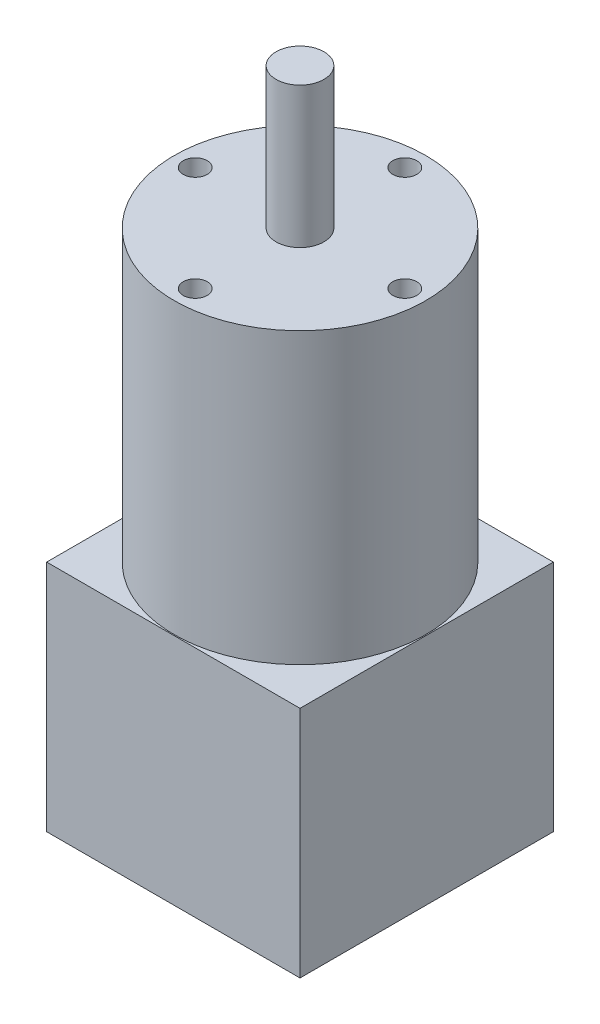
ISO-10303-21;
HEADER;
FILE_DESCRIPTION(('STEP AP214'),'2;1');
FILE_NAME('part.step','',(''),(''),'','','');
FILE_SCHEMA(('AUTOMOTIVE_DESIGN { 1 0 10303 214 1 1 1 1 }'));
ENDSEC;
DATA;
#1=APPLICATION_CONTEXT('core data for automotive mechanical design processes');
#2=APPLICATION_PROTOCOL_DEFINITION('international standard','automotive_design',2000,#1);
#3=PRODUCT_CONTEXT('',#1,'mechanical');
#4=PRODUCT('Part','Part','',(#3));
#5=PRODUCT_RELATED_PRODUCT_CATEGORY('part','',(#4));
#6=PRODUCT_DEFINITION_FORMATION('','',#4);
#7=PRODUCT_DEFINITION_CONTEXT('part definition',#1,'design');
#8=PRODUCT_DEFINITION('design','',#6,#7);
#9=PRODUCT_DEFINITION_SHAPE('','',#8);
#10=(LENGTH_UNIT() NAMED_UNIT(*) SI_UNIT(.MILLI.,.METRE.));
#11=(NAMED_UNIT(*) PLANE_ANGLE_UNIT() SI_UNIT($,.RADIAN.));
#12=(NAMED_UNIT(*) SI_UNIT($,.STERADIAN.) SOLID_ANGLE_UNIT());
#13=UNCERTAINTY_MEASURE_WITH_UNIT(LENGTH_MEASURE(1.E-05),#10,'distance_accuracy_value','');
#14=(GEOMETRIC_REPRESENTATION_CONTEXT(3) GLOBAL_UNCERTAINTY_ASSIGNED_CONTEXT((#13)) GLOBAL_UNIT_ASSIGNED_CONTEXT((#10,
#11,#12)) REPRESENTATION_CONTEXT('',''));
#15=CARTESIAN_POINT('',(0.,0.,0.));
#16=DIRECTION('',(0.,0.,1.));
#17=DIRECTION('',(1.,0.,0.));
#18=AXIS2_PLACEMENT_3D('',#15,#16,#17);
#19=CARTESIAN_POINT('',(0.,110.8,0.));
#20=DIRECTION('',(0.,-1.,0.));
#21=DIRECTION('',(0.,0.,-1.));
#22=AXIS2_PLACEMENT_3D('',#19,#20,#21);
#23=CYLINDRICAL_SURFACE('',#22,4.);
#24=CARTESIAN_POINT('',(0.,87.3,0.));
#25=DIRECTION('',(0.,1.,0.));
#26=DIRECTION('',(0.,0.,1.));
#27=AXIS2_PLACEMENT_3D('',#24,#25,#26);
#28=CIRCLE('',#27,4.);
#29=CARTESIAN_POINT('',(0.,87.3,4.));
#30=VERTEX_POINT('',#29);
#31=EDGE_CURVE('E151',#30,#30,#28,.T.);
#32=ORIENTED_EDGE('',*,*,#31,.T.);
#33=EDGE_LOOP('',(#32));
#34=FACE_BOUND('',#33,.T.);
#35=CARTESIAN_POINT('',(0.,110.8,0.));
#36=DIRECTION('',(0.,1.,0.));
#37=DIRECTION('',(0.,0.,1.));
#38=AXIS2_PLACEMENT_3D('',#35,#36,#37);
#39=CIRCLE('',#38,4.);
#40=CARTESIAN_POINT('',(0.,110.8,4.));
#41=VERTEX_POINT('',#40);
#42=EDGE_CURVE('E288',#41,#41,#39,.T.);
#43=ORIENTED_EDGE('',*,*,#42,.F.);
#44=EDGE_LOOP('',(#43));
#45=FACE_BOUND('',#44,.T.);
#46=DIRECTION('',(0.,-1.,0.));
#47=VECTOR('',#46,1.);
#48=CARTESIAN_POINT('',(-1.5,110.8,-3.70809924354783));
#49=LINE('',#48,#47);
#50=CARTESIAN_POINT('',(-1.5,106.7,-3.70809924354783));
#51=VERTEX_POINT('',#50);
#52=CARTESIAN_POINT('',(-1.5,95.7,-3.70809924354783));
#53=VERTEX_POINT('',#52);
#54=EDGE_CURVE('E157',#51,#53,#49,.T.);
#55=ORIENTED_EDGE('',*,*,#54,.T.);
#56=CARTESIAN_POINT('',(-1.5,95.7,-3.70809924354783));
#57=CARTESIAN_POINT('',(-1.50000149763685,95.6594059305553,-3.70809443488223));
#58=CARTESIAN_POINT('',(-1.49835105709717,95.6188329978994,-3.70876668409976));
#59=CARTESIAN_POINT('',(-1.49177843163966,95.5380093568391,-3.71141698257091));
#60=CARTESIAN_POINT('',(-1.48685734569824,95.4977585447944,-3.71339459320577));
#61=CARTESIAN_POINT('',(-1.4672933482067,95.378226826317,-3.72119033682707));
#62=CARTESIAN_POINT('',(-1.44784901310297,95.2997974497691,-3.72887225208868));
#63=CARTESIAN_POINT('',(-1.39690282812453,95.1476339471668,-3.74825199333564));
#64=CARTESIAN_POINT('',(-1.36541091184269,95.0738960111434,-3.75994650999366));
#65=CARTESIAN_POINT('',(-1.29134257885079,94.9326690628724,-3.7860233337759));
#66=CARTESIAN_POINT('',(-1.24875666733342,94.8651854708132,-3.80040794022651));
#67=CARTESIAN_POINT('',(-1.15146673631305,94.7351088724607,-3.83103570457934));
#68=CARTESIAN_POINT('',(-1.0963044481655,94.6728715264412,-3.84733331324471));
#69=CARTESIAN_POINT('',(-0.976395613097517,94.5582775205832,-3.87949750401636));
#70=CARTESIAN_POINT('',(-0.911646994469719,94.505923002106,-3.89536399207354));
#71=CARTESIAN_POINT('',(-0.771671110191602,94.4108435774906,-3.92553400925355));
#72=CARTESIAN_POINT('',(-0.696160035999181,94.3685118052143,-3.93976501267995));
#73=CARTESIAN_POINT('',(-0.538489868027633,94.2973265968158,-3.9643883038365));
#74=CARTESIAN_POINT('',(-0.456337903183924,94.2684589267464,-3.97478464304361));
#75=CARTESIAN_POINT('',(-0.311568360413163,94.2313833692295,-3.98831063781509));
#76=CARTESIAN_POINT('',(-0.249946259701632,94.2196498632232,-3.9926612104967));
#77=CARTESIAN_POINT('',(-0.125564806183786,94.2039443418765,-3.99852089820637));
#78=CARTESIAN_POINT('',(-0.062804988216711,94.1999755768709,-4.00002882328734));
#79=CARTESIAN_POINT('',(0.,94.2,-4.));
#80=B_SPLINE_CURVE_WITH_KNOTS('',3,(#56,#57,#58,#59,#60,#61,#62,#63,#64,#65,#66,#67,#68,#69,#70,
#71,#72,#73,#74,#75,#76,#77,#78,#79),.UNSPECIFIED.,.F.,.F.,(4,2,2,2,2,2,2,2,2,2,2,4),(0.,
0.121702070650527,0.243363268593937,0.485593089370354,0.727623613350272,0.969861963846899,
1.22297737762719,1.47614757238601,1.73802530937246,1.9996255640306,2.18773738057225,
2.37592792422954),.UNSPECIFIED.);
#81=CARTESIAN_POINT('',(0.,94.2,-4.));
#82=VERTEX_POINT('',#81);
#83=EDGE_CURVE('E63',#53,#82,#80,.T.);
#84=ORIENTED_EDGE('',*,*,#83,.T.);
#85=CARTESIAN_POINT('',(0.,94.2,-4.));
#86=CARTESIAN_POINT('',(0.0406958829842187,94.1999987715417,-4.0000033265242));
#87=CARTESIAN_POINT('',(0.0813709954107094,94.2016572436765,-3.99937821643425));
#88=CARTESIAN_POINT('',(0.162404982142699,94.2082636148125,-3.99690675065887));
#89=CARTESIAN_POINT('',(0.202763939083229,94.2132106231327,-3.99506072565186));
#90=CARTESIAN_POINT('',(0.322658818153228,94.2328868689112,-3.98776419542613));
#91=CARTESIAN_POINT('',(0.401351138250184,94.2524519115586,-3.98055464040178));
#92=CARTESIAN_POINT('',(0.554057247937605,94.3037487278131,-3.96219014943225));
#93=CARTESIAN_POINT('',(0.628073544622783,94.3354739160358,-3.9510373492233));
#94=CARTESIAN_POINT('',(0.769768846215137,94.4100889205701,-3.92589331480545));
#95=CARTESIAN_POINT('',(0.837443568408158,94.4529862089937,-3.91190018231573));
#96=CARTESIAN_POINT('',(0.967344906860734,94.5506106720114,-3.88186303805133));
#97=CARTESIAN_POINT('',(1.02926635746347,94.605725774499,-3.86576126025821));
#98=CARTESIAN_POINT('',(1.14324026520414,94.7254061833371,-3.83360332452306));
#99=CARTESIAN_POINT('',(1.19528897996651,94.7899750568822,-3.8175471861438));
#100=CARTESIAN_POINT('',(1.2900021675008,94.9297458027432,-3.78661824913521));
#101=CARTESIAN_POINT('',(1.3322282773455,95.005261304648,-3.77181479391607));
#102=CARTESIAN_POINT('',(1.40321260233322,95.1629257096992,-3.74598828763862));
#103=CARTESIAN_POINT('',(1.43198755826084,95.2450662174501,-3.73496054207913));
#104=CARTESIAN_POINT('',(1.4688507799066,95.3895938732747,-3.72058587751727));
#105=CARTESIAN_POINT('',(1.4804930770667,95.450966567495,-3.71594709538589));
#106=CARTESIAN_POINT('',(1.49608314541372,95.5748756822457,-3.70968378110959));
#107=CARTESIAN_POINT('',(1.50002515651037,95.6374129386371,-3.70806150546337));
#108=CARTESIAN_POINT('',(1.5,95.7,-3.70809924354783));
#109=B_SPLINE_CURVE_WITH_KNOTS('',3,(#85,#86,#87,#88,#89,#90,#91,#92,#93,#94,#95,#96,#97,#98,
#99,#100,#101,#102,#103,#104,#105,#106,#107,#108),.UNSPECIFIED.,.F.,.F.,(4,2,2,2,2,2,2,2,2,2,2,
4),(0.,0.122008525653371,0.243984019459629,0.486933412549048,0.729751420715084,
0.972732249088057,1.2249558748475,1.47727491867927,1.73930674597636,2.0010115846268,
2.18839922255605,2.37592697956525),.UNSPECIFIED.);
#110=CARTESIAN_POINT('',(1.5,95.7,-3.70809924354783));
#111=VERTEX_POINT('',#110);
#112=EDGE_CURVE('E189',#82,#111,#109,.T.);
#113=ORIENTED_EDGE('',*,*,#112,.T.);
#114=DIRECTION('',(0.,-1.,0.));
#115=VECTOR('',#114,1.);
#116=CARTESIAN_POINT('',(1.5,110.8,-3.70809924354783));
#117=LINE('',#116,#115);
#118=CARTESIAN_POINT('',(1.5,106.7,-3.70809924354783));
#119=VERTEX_POINT('',#118);
#120=EDGE_CURVE('E160',#111,#119,#117,.F.);
#121=ORIENTED_EDGE('',*,*,#120,.T.);
#122=CARTESIAN_POINT('',(1.5,106.7,-3.70809924354783));
#123=CARTESIAN_POINT('',(1.50000149763685,106.740594069445,-3.70809443488223));
#124=CARTESIAN_POINT('',(1.49835105709716,106.781167002101,-3.70876668409977));
#125=CARTESIAN_POINT('',(1.49177843163965,106.861990643161,-3.71141698257091));
#126=CARTESIAN_POINT('',(1.48685734569824,106.902241455206,-3.71339459320577));
#127=CARTESIAN_POINT('',(1.4672933482067,107.021773173683,-3.72119033682707));
#128=CARTESIAN_POINT('',(1.44784901310297,107.100202550231,-3.72887225208868));
#129=CARTESIAN_POINT('',(1.39690282812453,107.252366052833,-3.74825199333564));
#130=CARTESIAN_POINT('',(1.3654109118427,107.326103988857,-3.75994650999366));
#131=CARTESIAN_POINT('',(1.29134257885079,107.467330937128,-3.7860233337759));
#132=CARTESIAN_POINT('',(1.24875666733342,107.534814529187,-3.80040794022651));
#133=CARTESIAN_POINT('',(1.15146673631305,107.664891127539,-3.83103570457934));
#134=CARTESIAN_POINT('',(1.09630444816551,107.727128473559,-3.84733331324471));
#135=CARTESIAN_POINT('',(0.976395613097518,107.841722479417,-3.87949750401636));
#136=CARTESIAN_POINT('',(0.911646994469717,107.894076997894,-3.89536399207354));
#137=CARTESIAN_POINT('',(0.771671110191596,107.989156422509,-3.92553400925355));
#138=CARTESIAN_POINT('',(0.696160035999174,108.031488194786,-3.93976501267995));
#139=CARTESIAN_POINT('',(0.538489868027627,108.102673403184,-3.9643883038365));
#140=CARTESIAN_POINT('',(0.456337903183921,108.131541073254,-3.97478464304361));
#141=CARTESIAN_POINT('',(0.311568360413164,108.16861663077,-3.98831063781509));
#142=CARTESIAN_POINT('',(0.249946259701633,108.180350136777,-3.9926612104967));
#143=CARTESIAN_POINT('',(0.125564806183786,108.196055658123,-3.99852089820637));
#144=CARTESIAN_POINT('',(0.0628049882167101,108.200024423129,-4.00002882328734));
#145=CARTESIAN_POINT('',(0.,108.2,-4.));
#146=B_SPLINE_CURVE_WITH_KNOTS('',3,(#122,#123,#124,#125,#126,#127,#128,#129,#130,#131,#132,
#133,#134,#135,#136,#137,#138,#139,#140,#141,#142,#143,#144,#145),.UNSPECIFIED.,.F.,.F.,(4,2,2,
2,2,2,2,2,2,2,2,4),(0.,0.12170207065054,0.243363268593951,0.485593089370354,0.727623613350272,
0.969861963846899,1.2229773776272,1.47614757238601,1.73802530937248,1.9996255640306,
2.18773738057225,2.37592792422954),.UNSPECIFIED.);
#147=CARTESIAN_POINT('',(0.,108.2,-4.));
#148=VERTEX_POINT('',#147);
#149=EDGE_CURVE('E50',#119,#148,#146,.T.);
#150=ORIENTED_EDGE('',*,*,#149,.T.);
#151=CARTESIAN_POINT('',(0.,108.2,-4.));
#152=CARTESIAN_POINT('',(-0.0406958829842185,108.200001228458,-4.0000033265242));
#153=CARTESIAN_POINT('',(-0.0813709954107083,108.198342756323,-3.99937821643425));
#154=CARTESIAN_POINT('',(-0.162404982142698,108.191736385187,-3.99690675065887));
#155=CARTESIAN_POINT('',(-0.202763939083227,108.186789376867,-3.99506072565186));
#156=CARTESIAN_POINT('',(-0.322658818153227,108.167113131089,-3.98776419542613));
#157=CARTESIAN_POINT('',(-0.401351138250184,108.147548088441,-3.98055464040178));
#158=CARTESIAN_POINT('',(-0.554057247937611,108.096251272187,-3.96219014943225));
#159=CARTESIAN_POINT('',(-0.628073544622794,108.064526083964,-3.9510373492233));
#160=CARTESIAN_POINT('',(-0.769768846215147,107.98991107943,-3.92589331480545));
#161=CARTESIAN_POINT('',(-0.837443568408163,107.947013791006,-3.91190018231573));
#162=CARTESIAN_POINT('',(-0.967344906860735,107.849389327989,-3.88186303805133));
#163=CARTESIAN_POINT('',(-1.02926635746348,107.794274225501,-3.86576126025821));
#164=CARTESIAN_POINT('',(-1.14324026520414,107.674593816663,-3.83360332452306));
#165=CARTESIAN_POINT('',(-1.19528897996651,107.610024943118,-3.8175471861438));
#166=CARTESIAN_POINT('',(-1.2900021675008,107.470254197257,-3.78661824913521));
#167=CARTESIAN_POINT('',(-1.3322282773455,107.394738695352,-3.77181479391607));
#168=CARTESIAN_POINT('',(-1.40321260233322,107.237074290301,-3.74598828763861));
#169=CARTESIAN_POINT('',(-1.43198755826084,107.15493378255,-3.73496054207913));
#170=CARTESIAN_POINT('',(-1.4688507799066,107.010406126725,-3.72058587751726));
#171=CARTESIAN_POINT('',(-1.4804930770667,106.949033432505,-3.71594709538589));
#172=CARTESIAN_POINT('',(-1.49608314541372,106.825124317754,-3.7096837811096));
#173=CARTESIAN_POINT('',(-1.50002515651037,106.762587061363,-3.70806150546337));
#174=CARTESIAN_POINT('',(-1.5,106.7,-3.70809924354783));
#175=B_SPLINE_CURVE_WITH_KNOTS('',3,(#151,#152,#153,#154,#155,#156,#157,#158,#159,#160,#161,
#162,#163,#164,#165,#166,#167,#168,#169,#170,#171,#172,#173,#174),.UNSPECIFIED.,.F.,.F.,(4,2,2,
2,2,2,2,2,2,2,2,4),(0.,0.122008525653369,0.243984019459627,0.486933412549048,0.729751420715105,
0.972732249088057,1.2249558748475,1.47727491867927,1.73930674597636,2.0010115846268,
2.18839922255604,2.37592697956525),.UNSPECIFIED.);
#176=EDGE_CURVE('E11',#148,#51,#175,.T.);
#177=ORIENTED_EDGE('',*,*,#176,.T.);
#178=EDGE_LOOP('',(#55,#84,#113,#121,#150,#177));
#179=FACE_BOUND('',#178,.T.);
#180=ADVANCED_FACE('F39',(#34,#45,#179),#23,.T.);
#181=CARTESIAN_POINT('',(21.15,39.,21.15));
#182=DIRECTION('',(-1.,0.,0.));
#183=DIRECTION('',(0.,0.,1.));
#184=AXIS2_PLACEMENT_3D('',#181,#182,#183);
#185=PLANE('',#184);
#186=DIRECTION('',(0.,0.,-1.));
#187=VECTOR('',#186,1.);
#188=CARTESIAN_POINT('',(21.15,0.,21.15));
#189=LINE('',#188,#187);
#190=CARTESIAN_POINT('',(21.15,0.,21.15));
#191=VERTEX_POINT('',#190);
#192=CARTESIAN_POINT('',(21.15,0.,-21.15));
#193=VERTEX_POINT('',#192);
#194=EDGE_CURVE('E144',#191,#193,#189,.T.);
#195=ORIENTED_EDGE('',*,*,#194,.T.);
#196=DIRECTION('',(0.,-1.,0.));
#197=VECTOR('',#196,1.);
#198=CARTESIAN_POINT('',(21.15,39.,-21.15));
#199=LINE('',#198,#197);
#200=CARTESIAN_POINT('',(21.15,39.,-21.15));
#201=VERTEX_POINT('',#200);
#202=EDGE_CURVE('E122',#201,#193,#199,.T.);
#203=ORIENTED_EDGE('',*,*,#202,.F.);
#204=DIRECTION('',(0.,0.,-1.));
#205=VECTOR('',#204,1.);
#206=CARTESIAN_POINT('',(21.15,39.,21.15));
#207=LINE('',#206,#205);
#208=CARTESIAN_POINT('',(21.15,39.,21.15));
#209=VERTEX_POINT('',#208);
#210=EDGE_CURVE('E130',#209,#201,#207,.T.);
#211=ORIENTED_EDGE('',*,*,#210,.F.);
#212=DIRECTION('',(0.,-1.,0.));
#213=VECTOR('',#212,1.);
#214=CARTESIAN_POINT('',(21.15,39.,21.15));
#215=LINE('',#214,#213);
#216=EDGE_CURVE('E306',#209,#191,#215,.T.);
#217=ORIENTED_EDGE('',*,*,#216,.T.);
#218=EDGE_LOOP('',(#195,#203,#211,#217));
#219=FACE_BOUND('',#218,.T.);
#220=ADVANCED_FACE('F142',(#219),#185,.F.);
#221=CARTESIAN_POINT('',(-21.15,39.,-21.15));
#222=DIRECTION('',(0.,0.,1.));
#223=DIRECTION('',(1.,0.,0.));
#224=AXIS2_PLACEMENT_3D('',#221,#222,#223);
#225=PLANE('',#224);
#226=DIRECTION('',(-1.,0.,0.));
#227=VECTOR('',#226,1.);
#228=CARTESIAN_POINT('',(-21.15,0.,-21.15));
#229=LINE('',#228,#227);
#230=CARTESIAN_POINT('',(-21.15,0.,-21.15));
#231=VERTEX_POINT('',#230);
#232=EDGE_CURVE('E309',#193,#231,#229,.T.);
#233=ORIENTED_EDGE('',*,*,#232,.T.);
#234=DIRECTION('',(0.,-1.,0.));
#235=VECTOR('',#234,1.);
#236=CARTESIAN_POINT('',(-21.15,39.,-21.15));
#237=LINE('',#236,#235);
#238=CARTESIAN_POINT('',(-21.15,39.,-21.15));
#239=VERTEX_POINT('',#238);
#240=EDGE_CURVE('E125',#239,#231,#237,.T.);
#241=ORIENTED_EDGE('',*,*,#240,.F.);
#242=DIRECTION('',(-1.,0.,0.));
#243=VECTOR('',#242,1.);
#244=CARTESIAN_POINT('',(-21.15,39.,-21.15));
#245=LINE('',#244,#243);
#246=EDGE_CURVE('E118',#201,#239,#245,.T.);
#247=ORIENTED_EDGE('',*,*,#246,.F.);
#248=ORIENTED_EDGE('',*,*,#202,.T.);
#249=EDGE_LOOP('',(#233,#241,#247,#248));
#250=FACE_BOUND('',#249,.T.);
#251=ADVANCED_FACE('F120',(#250),#225,.F.);
#252=CARTESIAN_POINT('',(-21.15,39.,21.15));
#253=DIRECTION('',(1.,0.,0.));
#254=DIRECTION('',(0.,0.,-1.));
#255=AXIS2_PLACEMENT_3D('',#252,#253,#254);
#256=PLANE('',#255);
#257=DIRECTION('',(0.,0.,1.));
#258=VECTOR('',#257,1.);
#259=CARTESIAN_POINT('',(-21.15,0.,21.15));
#260=LINE('',#259,#258);
#261=CARTESIAN_POINT('',(-21.15,0.,21.15));
#262=VERTEX_POINT('',#261);
#263=EDGE_CURVE('E312',#231,#262,#260,.T.);
#264=ORIENTED_EDGE('',*,*,#263,.T.);
#265=DIRECTION('',(0.,-1.,0.));
#266=VECTOR('',#265,1.);
#267=CARTESIAN_POINT('',(-21.15,39.,21.15));
#268=LINE('',#267,#266);
#269=CARTESIAN_POINT('',(-21.15,39.,21.15));
#270=VERTEX_POINT('',#269);
#271=EDGE_CURVE('E153',#270,#262,#268,.T.);
#272=ORIENTED_EDGE('',*,*,#271,.F.);
#273=DIRECTION('',(0.,0.,1.));
#274=VECTOR('',#273,1.);
#275=CARTESIAN_POINT('',(-21.15,39.,21.15));
#276=LINE('',#275,#274);
#277=EDGE_CURVE('E129',#239,#270,#276,.T.);
#278=ORIENTED_EDGE('',*,*,#277,.F.);
#279=ORIENTED_EDGE('',*,*,#240,.T.);
#280=EDGE_LOOP('',(#264,#272,#278,#279));
#281=FACE_BOUND('',#280,.T.);
#282=ADVANCED_FACE('F328',(#281),#256,.F.);
#283=CARTESIAN_POINT('',(-21.15,39.,21.15));
#284=DIRECTION('',(0.,0.,-1.));
#285=DIRECTION('',(-1.,0.,0.));
#286=AXIS2_PLACEMENT_3D('',#283,#284,#285);
#287=PLANE('',#286);
#288=DIRECTION('',(1.,0.,0.));
#289=VECTOR('',#288,1.);
#290=CARTESIAN_POINT('',(-21.15,0.,21.15));
#291=LINE('',#290,#289);
#292=EDGE_CURVE('E140',#262,#191,#291,.T.);
#293=ORIENTED_EDGE('',*,*,#292,.T.);
#294=ORIENTED_EDGE('',*,*,#216,.F.);
#295=DIRECTION('',(1.,0.,0.));
#296=VECTOR('',#295,1.);
#297=CARTESIAN_POINT('',(-21.15,39.,21.15));
#298=LINE('',#297,#296);
#299=EDGE_CURVE('E135',#270,#209,#298,.T.);
#300=ORIENTED_EDGE('',*,*,#299,.F.);
#301=ORIENTED_EDGE('',*,*,#271,.T.);
#302=EDGE_LOOP('',(#293,#294,#300,#301));
#303=FACE_BOUND('',#302,.T.);
#304=ADVANCED_FACE('F323',(#303),#287,.F.);
#305=CARTESIAN_POINT('',(0.,39.,0.));
#306=DIRECTION('',(0.,-1.,0.));
#307=DIRECTION('',(0.,0.,-1.));
#308=AXIS2_PLACEMENT_3D('',#305,#306,#307);
#309=PLANE('',#308);
#310=CARTESIAN_POINT('',(0.,39.,0.));
#311=DIRECTION('',(0.,1.,0.));
#312=DIRECTION('',(0.,0.,1.));
#313=AXIS2_PLACEMENT_3D('',#310,#311,#312);
#314=CIRCLE('',#313,21.);
#315=CARTESIAN_POINT('',(0.,39.,-21.));
#316=VERTEX_POINT('',#315);
#317=EDGE_CURVE('E146',#316,#316,#314,.T.);
#318=ORIENTED_EDGE('',*,*,#317,.F.);
#319=EDGE_LOOP('',(#318));
#320=FACE_BOUND('',#319,.T.);
#321=ORIENTED_EDGE('',*,*,#210,.T.);
#322=ORIENTED_EDGE('',*,*,#246,.T.);
#323=ORIENTED_EDGE('',*,*,#277,.T.);
#324=ORIENTED_EDGE('',*,*,#299,.T.);
#325=EDGE_LOOP('',(#321,#322,#323,#324));
#326=FACE_BOUND('',#325,.T.);
#327=ADVANCED_FACE('F133',(#320,#326),#309,.F.);
#328=CARTESIAN_POINT('',(0.,0.,0.));
#329=DIRECTION('',(0.,-1.,0.));
#330=DIRECTION('',(0.,0.,-1.));
#331=AXIS2_PLACEMENT_3D('',#328,#329,#330);
#332=PLANE('',#331);
#333=CARTESIAN_POINT('',(0.,0.,0.));
#334=DIRECTION('',(0.,-1.,0.));
#335=DIRECTION('',(0.,0.,-1.));
#336=AXIS2_PLACEMENT_3D('',#333,#334,#335);
#337=CIRCLE('',#336,2.5);
#338=CARTESIAN_POINT('',(0.,0.,-2.5));
#339=VERTEX_POINT('',#338);
#340=EDGE_CURVE('E282',#339,#339,#337,.T.);
#341=ORIENTED_EDGE('',*,*,#340,.F.);
#342=EDGE_LOOP('',(#341));
#343=FACE_BOUND('',#342,.T.);
#344=ORIENTED_EDGE('',*,*,#194,.F.);
#345=ORIENTED_EDGE('',*,*,#292,.F.);
#346=ORIENTED_EDGE('',*,*,#263,.F.);
#347=ORIENTED_EDGE('',*,*,#232,.F.);
#348=EDGE_LOOP('',(#344,#345,#346,#347));
#349=FACE_BOUND('',#348,.T.);
#350=ADVANCED_FACE('F327',(#343,#349),#332,.T.);
#351=CARTESIAN_POINT('',(0.,87.3,0.));
#352=DIRECTION('',(0.,-1.,0.));
#353=DIRECTION('',(0.,0.,-1.));
#354=AXIS2_PLACEMENT_3D('',#351,#352,#353);
#355=CYLINDRICAL_SURFACE('',#354,21.);
#356=CARTESIAN_POINT('',(0.,87.3,0.));
#357=DIRECTION('',(0.,1.,0.));
#358=DIRECTION('',(0.,0.,1.));
#359=AXIS2_PLACEMENT_3D('',#356,#357,#358);
#360=CIRCLE('',#359,21.);
#361=CARTESIAN_POINT('',(0.,87.3,-21.));
#362=VERTEX_POINT('',#361);
#363=EDGE_CURVE('E295',#362,#362,#360,.T.);
#364=CARTESIAN_POINT('',(0.,87.3,-21.));
#365=CARTESIAN_POINT('',(0.,86.796875,-21.));
#366=CARTESIAN_POINT('',(0.,86.29375,-21.));
#367=CARTESIAN_POINT('',(0.,85.2875,-21.));
#368=CARTESIAN_POINT('',(0.,84.784375,-21.));
#369=CARTESIAN_POINT('',(0.,83.778125,-21.));
#370=CARTESIAN_POINT('',(0.,83.275,-21.));
#371=CARTESIAN_POINT('',(0.,82.26875,-21.));
#372=CARTESIAN_POINT('',(0.,81.765625,-21.));
#373=CARTESIAN_POINT('',(0.,80.759375,-21.));
#374=CARTESIAN_POINT('',(0.,80.25625,-21.));
#375=CARTESIAN_POINT('',(0.,79.25,-21.));
#376=CARTESIAN_POINT('',(0.,78.746875,-21.));
#377=CARTESIAN_POINT('',(0.,77.740625,-21.));
#378=CARTESIAN_POINT('',(0.,77.2375,-21.));
#379=CARTESIAN_POINT('',(0.,76.23125,-21.));
#380=CARTESIAN_POINT('',(0.,75.728125,-21.));
#381=CARTESIAN_POINT('',(0.,74.721875,-21.));
#382=CARTESIAN_POINT('',(0.,74.21875,-21.));
#383=CARTESIAN_POINT('',(0.,73.2125,-21.));
#384=CARTESIAN_POINT('',(0.,72.709375,-21.));
#385=CARTESIAN_POINT('',(0.,71.703125,-21.));
#386=CARTESIAN_POINT('',(0.,71.2,-21.));
#387=CARTESIAN_POINT('',(0.,70.19375,-21.));
#388=CARTESIAN_POINT('',(0.,69.690625,-21.));
#389=CARTESIAN_POINT('',(0.,68.684375,-21.));
#390=CARTESIAN_POINT('',(0.,68.18125,-21.));
#391=CARTESIAN_POINT('',(0.,67.175,-21.));
#392=CARTESIAN_POINT('',(0.,66.671875,-21.));
#393=CARTESIAN_POINT('',(0.,65.665625,-21.));
#394=CARTESIAN_POINT('',(0.,65.1625,-21.));
#395=CARTESIAN_POINT('',(0.,64.15625,-21.));
#396=CARTESIAN_POINT('',(0.,63.653125,-21.));
#397=CARTESIAN_POINT('',(0.,62.646875,-21.));
#398=CARTESIAN_POINT('',(0.,62.14375,-21.));
#399=CARTESIAN_POINT('',(0.,61.1375,-21.));
#400=CARTESIAN_POINT('',(0.,60.634375,-21.));
#401=CARTESIAN_POINT('',(0.,59.628125,-21.));
#402=CARTESIAN_POINT('',(0.,59.125,-21.));
#403=CARTESIAN_POINT('',(0.,58.11875,-21.));
#404=CARTESIAN_POINT('',(0.,57.615625,-21.));
#405=CARTESIAN_POINT('',(0.,56.609375,-21.));
#406=CARTESIAN_POINT('',(0.,56.10625,-21.));
#407=CARTESIAN_POINT('',(0.,55.1,-21.));
#408=CARTESIAN_POINT('',(0.,54.596875,-21.));
#409=CARTESIAN_POINT('',(0.,53.590625,-21.));
#410=CARTESIAN_POINT('',(0.,53.0875,-21.));
#411=CARTESIAN_POINT('',(0.,52.08125,-21.));
#412=CARTESIAN_POINT('',(0.,51.578125,-21.));
#413=CARTESIAN_POINT('',(0.,50.571875,-21.));
#414=CARTESIAN_POINT('',(0.,50.06875,-21.));
#415=CARTESIAN_POINT('',(0.,49.0625,-21.));
#416=CARTESIAN_POINT('',(0.,48.559375,-21.));
#417=CARTESIAN_POINT('',(0.,47.553125,-21.));
#418=CARTESIAN_POINT('',(0.,47.05,-21.));
#419=CARTESIAN_POINT('',(0.,46.04375,-21.));
#420=CARTESIAN_POINT('',(0.,45.540625,-21.));
#421=CARTESIAN_POINT('',(0.,44.534375,-21.));
#422=CARTESIAN_POINT('',(0.,44.03125,-21.));
#423=CARTESIAN_POINT('',(0.,43.025,-21.));
#424=CARTESIAN_POINT('',(0.,42.521875,-21.));
#425=CARTESIAN_POINT('',(0.,41.515625,-21.));
#426=CARTESIAN_POINT('',(0.,41.0125,-21.));
#427=CARTESIAN_POINT('',(0.,40.00625,-21.));
#428=CARTESIAN_POINT('',(0.,39.503125,-21.));
#429=CARTESIAN_POINT('',(0.,39.,-21.));
#430=B_SPLINE_CURVE_WITH_KNOTS('',3,(#364,#365,#366,#367,#368,#369,#370,#371,#372,#373,#374,
#375,#376,#377,#378,#379,#380,#381,#382,#383,#384,#385,#386,#387,#388,#389,#390,#391,#392,#393,
#394,#395,#396,#397,#398,#399,#400,#401,#402,#403,#404,#405,#406,#407,#408,#409,#410,#411,#412,
#413,#414,#415,#416,#417,#418,#419,#420,#421,#422,#423,#424,#425,#426,#427,#428,#429),
.UNSPECIFIED.,.F.,.F.,(4,2,2,2,2,2,2,2,2,2,2,2,2,2,2,2,2,2,2,2,2,2,2,2,2,2,2,2,2,2,2,2,4),(0.,
1.50937500000001,3.01875,4.52812500000001,6.0375,7.54687500000001,9.05625,10.565625,12.075,
13.584375,15.09375,16.603125,18.1125,19.621875,21.13125,22.640625,24.15,25.659375,27.16875,
28.678125,30.1875,31.696875,33.20625,34.715625,36.225,37.734375,39.24375,40.753125,42.2625,
43.771875,45.28125,46.790625,48.3),.UNSPECIFIED.);
#431=EDGE_CURVE('BSEAM385',#362,#316,#430,.T.);
#432=ORIENTED_EDGE('',*,*,#363,.F.);
#433=ORIENTED_EDGE('',*,*,#317,.T.);
#434=ORIENTED_EDGE('',*,*,#431,.T.);
#435=ORIENTED_EDGE('',*,*,#431,.F.);
#436=EDGE_LOOP('',(#432,#434,#433,#435));
#437=FACE_BOUND('',#436,.T.);
#438=ADVANCED_FACE('F385',(#437),#355,.T.);
#439=CARTESIAN_POINT('',(0.,87.3,0.));
#440=DIRECTION('',(0.,1.,0.));
#441=DIRECTION('',(0.,0.,1.));
#442=AXIS2_PLACEMENT_3D('',#439,#440,#441);
#443=PLANE('',#442);
#444=CARTESIAN_POINT('',(0.,87.3,-17.5));
#445=DIRECTION('',(0.,1.,0.));
#446=DIRECTION('',(0.,0.,1.));
#447=AXIS2_PLACEMENT_3D('',#444,#445,#446);
#448=CIRCLE('',#447,2.);
#449=CARTESIAN_POINT('',(0.,87.3,-15.5));
#450=VERTEX_POINT('',#449);
#451=EDGE_CURVE('E248',#450,#450,#448,.T.);
#452=ORIENTED_EDGE('',*,*,#451,.F.);
#453=EDGE_LOOP('',(#452));
#454=FACE_BOUND('',#453,.T.);
#455=CARTESIAN_POINT('',(17.5,87.3,0.));
#456=DIRECTION('',(0.,1.,0.));
#457=DIRECTION('',(0.,0.,1.));
#458=AXIS2_PLACEMENT_3D('',#455,#456,#457);
#459=CIRCLE('',#458,2.);
#460=CARTESIAN_POINT('',(17.5,87.3,2.));
#461=VERTEX_POINT('',#460);
#462=EDGE_CURVE('E260',#461,#461,#459,.T.);
#463=ORIENTED_EDGE('',*,*,#462,.F.);
#464=EDGE_LOOP('',(#463));
#465=FACE_BOUND('',#464,.T.);
#466=CARTESIAN_POINT('',(0.,87.3,17.5));
#467=DIRECTION('',(0.,1.,0.));
#468=DIRECTION('',(0.,0.,1.));
#469=AXIS2_PLACEMENT_3D('',#466,#467,#468);
#470=CIRCLE('',#469,2.);
#471=CARTESIAN_POINT('',(0.,87.3,19.5));
#472=VERTEX_POINT('',#471);
#473=EDGE_CURVE('E268',#472,#472,#470,.T.);
#474=ORIENTED_EDGE('',*,*,#473,.F.);
#475=EDGE_LOOP('',(#474));
#476=FACE_BOUND('',#475,.T.);
#477=CARTESIAN_POINT('',(-17.5,87.3,0.));
#478=DIRECTION('',(0.,1.,0.));
#479=DIRECTION('',(0.,0.,1.));
#480=AXIS2_PLACEMENT_3D('',#477,#478,#479);
#481=CIRCLE('',#480,2.);
#482=CARTESIAN_POINT('',(-17.5,87.3,2.));
#483=VERTEX_POINT('',#482);
#484=EDGE_CURVE('E276',#483,#483,#481,.T.);
#485=ORIENTED_EDGE('',*,*,#484,.F.);
#486=EDGE_LOOP('',(#485));
#487=FACE_BOUND('',#486,.T.);
#488=ORIENTED_EDGE('',*,*,#31,.F.);
#489=EDGE_LOOP('',(#488));
#490=FACE_BOUND('',#489,.T.);
#491=ORIENTED_EDGE('',*,*,#363,.T.);
#492=EDGE_LOOP('',(#491));
#493=FACE_BOUND('',#492,.T.);
#494=ADVANCED_FACE('F380',(#454,#465,#476,#487,#490,#493),#443,.T.);
#495=CARTESIAN_POINT('',(0.,110.8,0.));
#496=DIRECTION('',(0.,1.,0.));
#497=DIRECTION('',(0.,0.,1.));
#498=AXIS2_PLACEMENT_3D('',#495,#496,#497);
#499=PLANE('',#498);
#500=ORIENTED_EDGE('',*,*,#42,.T.);
#501=EDGE_LOOP('',(#500));
#502=FACE_BOUND('',#501,.T.);
#503=ADVANCED_FACE('F377',(#502),#499,.T.);
#504=CARTESIAN_POINT('',(0.,-9.5,0.));
#505=DIRECTION('',(0.,1.,0.));
#506=DIRECTION('',(0.,0.,1.));
#507=AXIS2_PLACEMENT_3D('',#504,#505,#506);
#508=CYLINDRICAL_SURFACE('',#507,2.5);
#509=CARTESIAN_POINT('',(0.,-9.5,0.));
#510=DIRECTION('',(0.,-1.,0.));
#511=DIRECTION('',(0.,0.,-1.));
#512=AXIS2_PLACEMENT_3D('',#509,#510,#511);
#513=CIRCLE('',#512,2.5);
#514=CARTESIAN_POINT('',(0.,-9.5,-2.5));
#515=VERTEX_POINT('',#514);
#516=EDGE_CURVE('E284',#515,#515,#513,.T.);
#517=ORIENTED_EDGE('',*,*,#516,.F.);
#518=EDGE_LOOP('',(#517));
#519=FACE_BOUND('',#518,.T.);
#520=ORIENTED_EDGE('',*,*,#340,.T.);
#521=EDGE_LOOP('',(#520));
#522=FACE_BOUND('',#521,.T.);
#523=ADVANCED_FACE('F374',(#519,#522),#508,.T.);
#524=CARTESIAN_POINT('',(0.,-9.5,0.));
#525=DIRECTION('',(0.,-1.,0.));
#526=DIRECTION('',(0.,0.,-1.));
#527=AXIS2_PLACEMENT_3D('',#524,#525,#526);
#528=PLANE('',#527);
#529=ORIENTED_EDGE('',*,*,#516,.T.);
#530=EDGE_LOOP('',(#529));
#531=FACE_BOUND('',#530,.T.);
#532=ADVANCED_FACE('F368',(#531),#528,.T.);
#533=CARTESIAN_POINT('',(1.5,94.2,-5.2));
#534=DIRECTION('',(1.,0.,0.));
#535=DIRECTION('',(0.,0.,-1.));
#536=AXIS2_PLACEMENT_3D('',#533,#534,#535);
#537=PLANE('',#536);
#538=ORIENTED_EDGE('',*,*,#120,.F.);
#539=DIRECTION('',(0.,0.,-1.));
#540=VECTOR('',#539,1.);
#541=CARTESIAN_POINT('',(1.5,95.7,-5.2));
#542=LINE('',#541,#540);
#543=CARTESIAN_POINT('',(1.5,95.7,-2.2));
#544=VERTEX_POINT('',#543);
#545=EDGE_CURVE('E167',#111,#544,#542,.F.);
#546=ORIENTED_EDGE('',*,*,#545,.T.);
#547=DIRECTION('',(0.,1.,0.));
#548=VECTOR('',#547,1.);
#549=CARTESIAN_POINT('',(1.5,94.2,-2.2));
#550=LINE('',#549,#548);
#551=CARTESIAN_POINT('',(1.5,106.7,-2.2));
#552=VERTEX_POINT('',#551);
#553=EDGE_CURVE('E240',#544,#552,#550,.T.);
#554=ORIENTED_EDGE('',*,*,#553,.T.);
#555=DIRECTION('',(0.,0.,-1.));
#556=VECTOR('',#555,1.);
#557=CARTESIAN_POINT('',(1.5,106.7,-3.70809924354783));
#558=LINE('',#557,#556);
#559=EDGE_CURVE('E163',#552,#119,#558,.T.);
#560=ORIENTED_EDGE('',*,*,#559,.T.);
#561=EDGE_LOOP('',(#538,#546,#554,#560));
#562=FACE_BOUND('',#561,.T.);
#563=ADVANCED_FACE('F353',(#562),#537,.F.);
#564=CARTESIAN_POINT('',(-1.5,94.2,-5.2));
#565=DIRECTION('',(-1.,0.,0.));
#566=DIRECTION('',(0.,0.,1.));
#567=AXIS2_PLACEMENT_3D('',#564,#565,#566);
#568=PLANE('',#567);
#569=DIRECTION('',(0.,1.,0.));
#570=VECTOR('',#569,1.);
#571=CARTESIAN_POINT('',(-1.5,94.2,-2.2));
#572=LINE('',#571,#570);
#573=CARTESIAN_POINT('',(-1.5,95.7,-2.2));
#574=VERTEX_POINT('',#573);
#575=CARTESIAN_POINT('',(-1.5,106.7,-2.2));
#576=VERTEX_POINT('',#575);
#577=EDGE_CURVE('E235',#574,#576,#572,.T.);
#578=ORIENTED_EDGE('',*,*,#577,.F.);
#579=DIRECTION('',(0.,0.,1.));
#580=VECTOR('',#579,1.);
#581=CARTESIAN_POINT('',(-1.5,95.7,-5.2));
#582=LINE('',#581,#580);
#583=EDGE_CURVE('E186',#574,#53,#582,.F.);
#584=ORIENTED_EDGE('',*,*,#583,.T.);
#585=ORIENTED_EDGE('',*,*,#54,.F.);
#586=DIRECTION('',(0.,0.,1.));
#587=VECTOR('',#586,1.);
#588=CARTESIAN_POINT('',(-1.5,106.7,-2.2));
#589=LINE('',#588,#587);
#590=EDGE_CURVE('E183',#51,#576,#589,.T.);
#591=ORIENTED_EDGE('',*,*,#590,.T.);
#592=EDGE_LOOP('',(#578,#584,#585,#591));
#593=FACE_BOUND('',#592,.T.);
#594=ADVANCED_FACE('F360',(#593),#568,.F.);
#595=CARTESIAN_POINT('',(-1.5,94.2,-2.2));
#596=DIRECTION('',(0.,0.,1.));
#597=DIRECTION('',(1.,0.,0.));
#598=AXIS2_PLACEMENT_3D('',#595,#596,#597);
#599=PLANE('',#598);
#600=ORIENTED_EDGE('',*,*,#553,.F.);
#601=CARTESIAN_POINT('',(0.,95.7,-2.2));
#602=DIRECTION('',(0.,0.,1.));
#603=DIRECTION('',(1.,0.,0.));
#604=AXIS2_PLACEMENT_3D('',#601,#602,#603);
#605=CIRCLE('',#604,1.5);
#606=CARTESIAN_POINT('',(0.,94.2,-2.2));
#607=VERTEX_POINT('',#606);
#608=EDGE_CURVE('E180',#544,#607,#605,.F.);
#609=ORIENTED_EDGE('',*,*,#608,.T.);
#610=CARTESIAN_POINT('',(0.,95.7,-2.2));
#611=DIRECTION('',(0.,0.,1.));
#612=DIRECTION('',(1.,0.,0.));
#613=AXIS2_PLACEMENT_3D('',#610,#611,#612);
#614=CIRCLE('',#613,1.5);
#615=EDGE_CURVE('E177',#607,#574,#614,.F.);
#616=ORIENTED_EDGE('',*,*,#615,.T.);
#617=ORIENTED_EDGE('',*,*,#577,.T.);
#618=CARTESIAN_POINT('',(0.,106.7,-2.2));
#619=DIRECTION('',(0.,0.,1.));
#620=DIRECTION('',(1.,0.,0.));
#621=AXIS2_PLACEMENT_3D('',#618,#619,#620);
#622=CIRCLE('',#621,1.5);
#623=CARTESIAN_POINT('',(0.,108.2,-2.2));
#624=VERTEX_POINT('',#623);
#625=EDGE_CURVE('E171',#576,#624,#622,.F.);
#626=ORIENTED_EDGE('',*,*,#625,.T.);
#627=CARTESIAN_POINT('',(0.,106.7,-2.2));
#628=DIRECTION('',(0.,0.,1.));
#629=DIRECTION('',(1.,0.,0.));
#630=AXIS2_PLACEMENT_3D('',#627,#628,#629);
#631=CIRCLE('',#630,1.5);
#632=EDGE_CURVE('E174',#624,#552,#631,.F.);
#633=ORIENTED_EDGE('',*,*,#632,.T.);
#634=EDGE_LOOP('',(#600,#609,#616,#617,#626,#633));
#635=FACE_BOUND('',#634,.T.);
#636=ADVANCED_FACE('F216',(#635),#599,.F.);
#637=CARTESIAN_POINT('',(0.,95.7,0.));
#638=DIRECTION('',(0.,0.,1.));
#639=DIRECTION('',(1.,0.,0.));
#640=AXIS2_PLACEMENT_3D('',#637,#638,#639);
#641=CYLINDRICAL_SURFACE('',#640,1.5);
#642=ORIENTED_EDGE('',*,*,#583,.F.);
#643=ORIENTED_EDGE('',*,*,#615,.F.);
#644=DIRECTION('',(0.,0.,1.));
#645=VECTOR('',#644,1.);
#646=CARTESIAN_POINT('',(0.,94.2,0.));
#647=LINE('',#646,#645);
#648=EDGE_CURVE('E232',#82,#607,#647,.T.);
#649=ORIENTED_EDGE('',*,*,#648,.F.);
#650=ORIENTED_EDGE('',*,*,#83,.F.);
#651=EDGE_LOOP('',(#642,#643,#649,#650));
#652=FACE_BOUND('',#651,.T.);
#653=ADVANCED_FACE('F211',(#652),#641,.F.);
#654=CARTESIAN_POINT('',(0.,95.7,0.));
#655=DIRECTION('',(0.,0.,-1.));
#656=DIRECTION('',(-1.,0.,0.));
#657=AXIS2_PLACEMENT_3D('',#654,#655,#656);
#658=CYLINDRICAL_SURFACE('',#657,1.5);
#659=ORIENTED_EDGE('',*,*,#608,.F.);
#660=ORIENTED_EDGE('',*,*,#545,.F.);
#661=ORIENTED_EDGE('',*,*,#112,.F.);
#662=ORIENTED_EDGE('',*,*,#648,.T.);
#663=EDGE_LOOP('',(#659,#660,#661,#662));
#664=FACE_BOUND('',#663,.T.);
#665=ADVANCED_FACE('F207',(#664),#658,.F.);
#666=CARTESIAN_POINT('',(0.,106.7,-5.2));
#667=DIRECTION('',(0.,0.,-1.));
#668=DIRECTION('',(-1.,0.,0.));
#669=AXIS2_PLACEMENT_3D('',#666,#667,#668);
#670=CYLINDRICAL_SURFACE('',#669,1.5);
#671=DIRECTION('',(0.,0.,1.));
#672=VECTOR('',#671,1.);
#673=CARTESIAN_POINT('',(0.,108.2,-3.70809924354783));
#674=LINE('',#673,#672);
#675=EDGE_CURVE('E44',#624,#148,#674,.F.);
#676=ORIENTED_EDGE('',*,*,#675,.F.);
#677=ORIENTED_EDGE('',*,*,#625,.F.);
#678=ORIENTED_EDGE('',*,*,#590,.F.);
#679=ORIENTED_EDGE('',*,*,#176,.F.);
#680=EDGE_LOOP('',(#676,#677,#678,#679));
#681=FACE_BOUND('',#680,.T.);
#682=ADVANCED_FACE('F41',(#681),#670,.F.);
#683=CARTESIAN_POINT('',(0.,106.7,-5.2));
#684=DIRECTION('',(0.,0.,1.));
#685=DIRECTION('',(1.,0.,0.));
#686=AXIS2_PLACEMENT_3D('',#683,#684,#685);
#687=CYLINDRICAL_SURFACE('',#686,1.5);
#688=ORIENTED_EDGE('',*,*,#632,.F.);
#689=ORIENTED_EDGE('',*,*,#675,.T.);
#690=ORIENTED_EDGE('',*,*,#149,.F.);
#691=ORIENTED_EDGE('',*,*,#559,.F.);
#692=EDGE_LOOP('',(#688,#689,#690,#691));
#693=FACE_BOUND('',#692,.T.);
#694=ADVANCED_FACE('F218',(#693),#687,.F.);
#695=CARTESIAN_POINT('',(-17.5,80.3,0.));
#696=DIRECTION('',(0.,1.,0.));
#697=DIRECTION('',(0.,0.,1.));
#698=AXIS2_PLACEMENT_3D('',#695,#696,#697);
#699=CYLINDRICAL_SURFACE('',#698,2.);
#700=CARTESIAN_POINT('',(-17.5,80.3,0.));
#701=DIRECTION('',(0.,1.,0.));
#702=DIRECTION('',(0.,0.,1.));
#703=AXIS2_PLACEMENT_3D('',#700,#701,#702);
#704=CIRCLE('',#703,2.);
#705=CARTESIAN_POINT('',(-17.5,80.3,2.));
#706=VERTEX_POINT('',#705);
#707=EDGE_CURVE('E272',#706,#706,#704,.T.);
#708=ORIENTED_EDGE('',*,*,#707,.F.);
#709=EDGE_LOOP('',(#708));
#710=FACE_BOUND('',#709,.T.);
#711=ORIENTED_EDGE('',*,*,#484,.T.);
#712=EDGE_LOOP('',(#711));
#713=FACE_BOUND('',#712,.T.);
#714=ADVANCED_FACE('F221',(#710,#713),#699,.F.);
#715=CARTESIAN_POINT('',(-17.5,80.3,0.));
#716=DIRECTION('',(0.,1.,0.));
#717=DIRECTION('',(0.,0.,1.));
#718=AXIS2_PLACEMENT_3D('',#715,#716,#717);
#719=PLANE('',#718);
#720=ORIENTED_EDGE('',*,*,#707,.T.);
#721=EDGE_LOOP('',(#720));
#722=FACE_BOUND('',#721,.T.);
#723=ADVANCED_FACE('F479',(#722),#719,.T.);
#724=CARTESIAN_POINT('',(0.,80.3,17.5));
#725=DIRECTION('',(0.,1.,0.));
#726=DIRECTION('',(0.,0.,1.));
#727=AXIS2_PLACEMENT_3D('',#724,#725,#726);
#728=CYLINDRICAL_SURFACE('',#727,2.);
#729=CARTESIAN_POINT('',(0.,80.3,17.5));
#730=DIRECTION('',(0.,1.,0.));
#731=DIRECTION('',(0.,0.,1.));
#732=AXIS2_PLACEMENT_3D('',#729,#730,#731);
#733=CIRCLE('',#732,2.);
#734=CARTESIAN_POINT('',(0.,80.3,19.5));
#735=VERTEX_POINT('',#734);
#736=EDGE_CURVE('E264',#735,#735,#733,.T.);
#737=ORIENTED_EDGE('',*,*,#736,.F.);
#738=EDGE_LOOP('',(#737));
#739=FACE_BOUND('',#738,.T.);
#740=ORIENTED_EDGE('',*,*,#473,.T.);
#741=EDGE_LOOP('',(#740));
#742=FACE_BOUND('',#741,.T.);
#743=ADVANCED_FACE('F487',(#739,#742),#728,.F.);
#744=CARTESIAN_POINT('',(0.,80.3,17.5));
#745=DIRECTION('',(0.,1.,0.));
#746=DIRECTION('',(0.,0.,1.));
#747=AXIS2_PLACEMENT_3D('',#744,#745,#746);
#748=PLANE('',#747);
#749=ORIENTED_EDGE('',*,*,#736,.T.);
#750=EDGE_LOOP('',(#749));
#751=FACE_BOUND('',#750,.T.);
#752=ADVANCED_FACE('F496',(#751),#748,.T.);
#753=CARTESIAN_POINT('',(17.5,80.3,0.));
#754=DIRECTION('',(0.,1.,0.));
#755=DIRECTION('',(0.,0.,1.));
#756=AXIS2_PLACEMENT_3D('',#753,#754,#755);
#757=CYLINDRICAL_SURFACE('',#756,2.);
#758=CARTESIAN_POINT('',(17.5,80.3,0.));
#759=DIRECTION('',(0.,1.,0.));
#760=DIRECTION('',(0.,0.,1.));
#761=AXIS2_PLACEMENT_3D('',#758,#759,#760);
#762=CIRCLE('',#761,2.);
#763=CARTESIAN_POINT('',(17.5,80.3,2.));
#764=VERTEX_POINT('',#763);
#765=EDGE_CURVE('E254',#764,#764,#762,.T.);
#766=ORIENTED_EDGE('',*,*,#765,.F.);
#767=EDGE_LOOP('',(#766));
#768=FACE_BOUND('',#767,.T.);
#769=ORIENTED_EDGE('',*,*,#462,.T.);
#770=EDGE_LOOP('',(#769));
#771=FACE_BOUND('',#770,.T.);
#772=ADVANCED_FACE('F505',(#768,#771),#757,.F.);
#773=CARTESIAN_POINT('',(17.5,80.3,0.));
#774=DIRECTION('',(0.,1.,0.));
#775=DIRECTION('',(0.,0.,1.));
#776=AXIS2_PLACEMENT_3D('',#773,#774,#775);
#777=PLANE('',#776);
#778=ORIENTED_EDGE('',*,*,#765,.T.);
#779=EDGE_LOOP('',(#778));
#780=FACE_BOUND('',#779,.T.);
#781=ADVANCED_FACE('F514',(#780),#777,.T.);
#782=CARTESIAN_POINT('',(0.,80.3,-17.5));
#783=DIRECTION('',(0.,1.,0.));
#784=DIRECTION('',(0.,0.,1.));
#785=AXIS2_PLACEMENT_3D('',#782,#783,#784);
#786=CYLINDRICAL_SURFACE('',#785,2.);
#787=CARTESIAN_POINT('',(0.,80.3,-17.5));
#788=DIRECTION('',(0.,1.,0.));
#789=DIRECTION('',(0.,0.,1.));
#790=AXIS2_PLACEMENT_3D('',#787,#788,#789);
#791=CIRCLE('',#790,2.);
#792=CARTESIAN_POINT('',(0.,80.3,-15.5));
#793=VERTEX_POINT('',#792);
#794=EDGE_CURVE('E243',#793,#793,#791,.T.);
#795=ORIENTED_EDGE('',*,*,#794,.F.);
#796=EDGE_LOOP('',(#795));
#797=FACE_BOUND('',#796,.T.);
#798=ORIENTED_EDGE('',*,*,#451,.T.);
#799=EDGE_LOOP('',(#798));
#800=FACE_BOUND('',#799,.T.);
#801=ADVANCED_FACE('F523',(#797,#800),#786,.F.);
#802=CARTESIAN_POINT('',(0.,80.3,-17.5));
#803=DIRECTION('',(0.,1.,0.));
#804=DIRECTION('',(0.,0.,1.));
#805=AXIS2_PLACEMENT_3D('',#802,#803,#804);
#806=PLANE('',#805);
#807=ORIENTED_EDGE('',*,*,#794,.T.);
#808=EDGE_LOOP('',(#807));
#809=FACE_BOUND('',#808,.T.);
#810=ADVANCED_FACE('F532',(#809),#806,.T.);
#811=CLOSED_SHELL('',(#180,#220,#251,#282,#304,#327,#350,#438,#494,#503,#523,#532,#563,#594,
#636,#653,#665,#682,#694,#714,#723,#743,#752,#772,#781,#801,#810));
#812=MANIFOLD_SOLID_BREP('B2',#811);
#813=ADVANCED_BREP_SHAPE_REPRESENTATION('',(#18,#812),#14);
#814=SHAPE_DEFINITION_REPRESENTATION(#9,#813);
ENDSEC;
END-ISO-10303-21;
